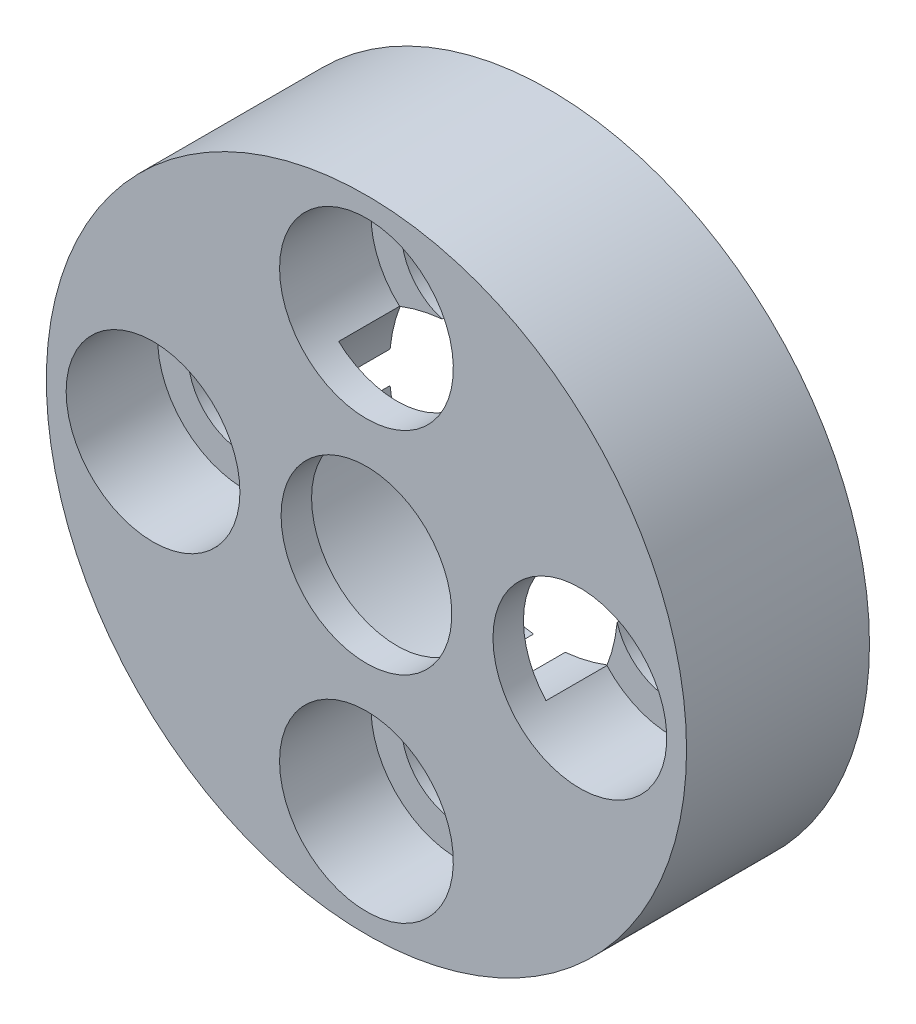
ISO-10303-21;
HEADER;
FILE_DESCRIPTION(('STEP AP214'),'2;1');
FILE_NAME('part.step','',(''),(''),'','','');
FILE_SCHEMA(('AUTOMOTIVE_DESIGN { 1 0 10303 214 1 1 1 1 }'));
ENDSEC;
DATA;
#1=APPLICATION_CONTEXT('core data for automotive mechanical design processes');
#2=APPLICATION_PROTOCOL_DEFINITION('international standard','automotive_design',2000,#1);
#3=PRODUCT_CONTEXT('',#1,'mechanical');
#4=PRODUCT('Part','Part','',(#3));
#5=PRODUCT_RELATED_PRODUCT_CATEGORY('part','',(#4));
#6=PRODUCT_DEFINITION_FORMATION('','',#4);
#7=PRODUCT_DEFINITION_CONTEXT('part definition',#1,'design');
#8=PRODUCT_DEFINITION('design','',#6,#7);
#9=PRODUCT_DEFINITION_SHAPE('','',#8);
#10=(LENGTH_UNIT() NAMED_UNIT(*) SI_UNIT(.MILLI.,.METRE.));
#11=(NAMED_UNIT(*) PLANE_ANGLE_UNIT() SI_UNIT($,.RADIAN.));
#12=(NAMED_UNIT(*) SI_UNIT($,.STERADIAN.) SOLID_ANGLE_UNIT());
#13=UNCERTAINTY_MEASURE_WITH_UNIT(LENGTH_MEASURE(1.E-05),#10,'distance_accuracy_value','');
#14=(GEOMETRIC_REPRESENTATION_CONTEXT(3) GLOBAL_UNCERTAINTY_ASSIGNED_CONTEXT((#13)) GLOBAL_UNIT_ASSIGNED_CONTEXT((#10,
#11,#12)) REPRESENTATION_CONTEXT('',''));
#15=CARTESIAN_POINT('',(0.,0.,0.));
#16=DIRECTION('',(0.,0.,1.));
#17=DIRECTION('',(1.,0.,0.));
#18=AXIS2_PLACEMENT_3D('',#15,#16,#17);
#19=CARTESIAN_POINT('',(0.,0.,6.));
#20=DIRECTION('',(0.,0.,1.));
#21=DIRECTION('',(1.,0.,0.));
#22=AXIS2_PLACEMENT_3D('',#19,#20,#21);
#23=PLANE('',#22);
#24=CARTESIAN_POINT('',(0.,-7.,6.));
#25=DIRECTION('',(0.,0.,-1.));
#26=DIRECTION('',(-1.,0.,0.));
#27=AXIS2_PLACEMENT_3D('',#24,#25,#26);
#28=CIRCLE('',#27,2.85);
#29=CARTESIAN_POINT('',(-2.85,-7.,6.));
#30=VERTEX_POINT('',#29);
#31=EDGE_CURVE('E174',#30,#30,#28,.T.);
#32=ORIENTED_EDGE('',*,*,#31,.T.);
#33=EDGE_LOOP('',(#32));
#34=FACE_BOUND('',#33,.T.);
#35=CARTESIAN_POINT('',(0.,7.,6.));
#36=DIRECTION('',(0.,0.,-1.));
#37=DIRECTION('',(-1.,0.,0.));
#38=AXIS2_PLACEMENT_3D('',#35,#36,#37);
#39=CIRCLE('',#38,2.85);
#40=CARTESIAN_POINT('',(-2.85,7.,6.));
#41=VERTEX_POINT('',#40);
#42=EDGE_CURVE('E284',#41,#41,#39,.T.);
#43=ORIENTED_EDGE('',*,*,#42,.T.);
#44=EDGE_LOOP('',(#43));
#45=FACE_BOUND('',#44,.T.);
#46=CARTESIAN_POINT('',(0.,0.,6.));
#47=DIRECTION('',(0.,0.,-1.));
#48=DIRECTION('',(-1.,0.,0.));
#49=AXIS2_PLACEMENT_3D('',#46,#47,#48);
#50=CIRCLE('',#49,2.8);
#51=CARTESIAN_POINT('',(-2.8,0.,6.));
#52=VERTEX_POINT('',#51);
#53=EDGE_CURVE('E207',#52,#52,#50,.T.);
#54=ORIENTED_EDGE('',*,*,#53,.T.);
#55=EDGE_LOOP('',(#54));
#56=FACE_BOUND('',#55,.T.);
#57=CARTESIAN_POINT('',(0.,0.,6.));
#58=DIRECTION('',(0.,0.,1.));
#59=DIRECTION('',(1.,0.,0.));
#60=AXIS2_PLACEMENT_3D('',#57,#58,#59);
#61=CIRCLE('',#60,10.5);
#62=CARTESIAN_POINT('',(10.5,0.,6.));
#63=VERTEX_POINT('',#62);
#64=EDGE_CURVE('E248',#63,#63,#61,.T.);
#65=ORIENTED_EDGE('',*,*,#64,.T.);
#66=EDGE_LOOP('',(#65));
#67=FACE_BOUND('',#66,.T.);
#68=CARTESIAN_POINT('',(7.,0.,6.));
#69=DIRECTION('',(0.,0.,-1.));
#70=DIRECTION('',(-1.,0.,0.));
#71=AXIS2_PLACEMENT_3D('',#68,#69,#70);
#72=CIRCLE('',#71,2.85);
#73=CARTESIAN_POINT('',(4.15,0.,6.));
#74=VERTEX_POINT('',#73);
#75=EDGE_CURVE('E335',#74,#74,#72,.T.);
#76=ORIENTED_EDGE('',*,*,#75,.T.);
#77=EDGE_LOOP('',(#76));
#78=FACE_BOUND('',#77,.T.);
#79=CARTESIAN_POINT('',(-7.,0.,6.));
#80=DIRECTION('',(0.,0.,-1.));
#81=DIRECTION('',(-1.,0.,0.));
#82=AXIS2_PLACEMENT_3D('',#79,#80,#81);
#83=CIRCLE('',#82,2.85);
#84=CARTESIAN_POINT('',(-9.85,0.,6.));
#85=VERTEX_POINT('',#84);
#86=EDGE_CURVE('E485',#85,#85,#83,.T.);
#87=ORIENTED_EDGE('',*,*,#86,.T.);
#88=EDGE_LOOP('',(#87));
#89=FACE_BOUND('',#88,.T.);
#90=ADVANCED_FACE('F41',(#34,#45,#56,#67,#78,#89),#23,.T.);
#91=CARTESIAN_POINT('',(7.,0.,6.));
#92=DIRECTION('',(0.,0.,-1.));
#93=DIRECTION('',(-1.,0.,0.));
#94=AXIS2_PLACEMENT_3D('',#91,#92,#93);
#95=CYLINDRICAL_SURFACE('',#94,1.85);
#96=DIRECTION('',(0.,0.,-1.));
#97=VECTOR('',#96,1.);
#98=CARTESIAN_POINT('',(5.22428571428572,-0.518978588681864,2.5));
#99=LINE('',#98,#97);
#100=CARTESIAN_POINT('',(5.22428571428572,-0.518978588681864,3.));
#101=VERTEX_POINT('',#100);
#102=CARTESIAN_POINT('',(5.22428571428572,-0.518978588681863,0.));
#103=VERTEX_POINT('',#102);
#104=EDGE_CURVE('E230',#101,#103,#99,.T.);
#105=ORIENTED_EDGE('',*,*,#104,.F.);
#106=CARTESIAN_POINT('',(7.,0.,3.));
#107=DIRECTION('',(0.,0.,1.));
#108=DIRECTION('',(1.,0.,0.));
#109=AXIS2_PLACEMENT_3D('',#106,#107,#108);
#110=CIRCLE('',#109,1.85);
#111=CARTESIAN_POINT('',(5.22428571428572,0.518978588681865,3.));
#112=VERTEX_POINT('',#111);
#113=EDGE_CURVE('E317',#101,#112,#110,.T.);
#114=ORIENTED_EDGE('',*,*,#113,.T.);
#115=DIRECTION('',(0.,0.,-1.));
#116=VECTOR('',#115,1.);
#117=CARTESIAN_POINT('',(5.22428571428572,0.518978588681865,2.5));
#118=LINE('',#117,#116);
#119=CARTESIAN_POINT('',(5.22428571428572,0.518978588681865,0.));
#120=VERTEX_POINT('',#119);
#121=EDGE_CURVE('E232',#120,#112,#118,.F.);
#122=ORIENTED_EDGE('',*,*,#121,.F.);
#123=CARTESIAN_POINT('',(7.,0.,0.));
#124=DIRECTION('',(0.,0.,1.));
#125=DIRECTION('',(1.,0.,0.));
#126=AXIS2_PLACEMENT_3D('',#123,#124,#125);
#127=CIRCLE('',#126,1.85);
#128=EDGE_CURVE('E244',#103,#120,#127,.T.);
#129=ORIENTED_EDGE('',*,*,#128,.F.);
#130=EDGE_LOOP('',(#105,#114,#122,#129));
#131=FACE_BOUND('',#130,.T.);
#132=ADVANCED_FACE('F316',(#131),#95,.F.);
#133=CARTESIAN_POINT('',(0.,-7.,6.));
#134=DIRECTION('',(0.,0.,-1.));
#135=DIRECTION('',(-1.,0.,0.));
#136=AXIS2_PLACEMENT_3D('',#133,#134,#135);
#137=CYLINDRICAL_SURFACE('',#136,1.85);
#138=DIRECTION('',(0.,0.,-1.));
#139=VECTOR('',#138,1.);
#140=CARTESIAN_POINT('',(-0.518978588681849,-5.22428571428571,2.5));
#141=LINE('',#140,#139);
#142=CARTESIAN_POINT('',(-0.518978588681849,-5.22428571428571,3.));
#143=VERTEX_POINT('',#142);
#144=CARTESIAN_POINT('',(-0.518978588681849,-5.22428571428571,0.));
#145=VERTEX_POINT('',#144);
#146=EDGE_CURVE('E227',#143,#145,#141,.T.);
#147=ORIENTED_EDGE('',*,*,#146,.F.);
#148=CARTESIAN_POINT('',(0.,-7.,3.));
#149=DIRECTION('',(0.,0.,1.));
#150=DIRECTION('',(1.,0.,0.));
#151=AXIS2_PLACEMENT_3D('',#148,#149,#150);
#152=CIRCLE('',#151,1.85);
#153=CARTESIAN_POINT('',(0.518978588681852,-5.22428571428572,3.));
#154=VERTEX_POINT('',#153);
#155=EDGE_CURVE('E181',#143,#154,#152,.T.);
#156=ORIENTED_EDGE('',*,*,#155,.T.);
#157=DIRECTION('',(0.,0.,-1.));
#158=VECTOR('',#157,1.);
#159=CARTESIAN_POINT('',(0.518978588681851,-5.22428571428571,2.5));
#160=LINE('',#159,#158);
#161=CARTESIAN_POINT('',(0.518978588681852,-5.22428571428571,0.));
#162=VERTEX_POINT('',#161);
#163=EDGE_CURVE('E180',#162,#154,#160,.F.);
#164=ORIENTED_EDGE('',*,*,#163,.F.);
#165=CARTESIAN_POINT('',(0.,-7.,0.));
#166=DIRECTION('',(0.,0.,1.));
#167=DIRECTION('',(1.,0.,0.));
#168=AXIS2_PLACEMENT_3D('',#165,#166,#167);
#169=CIRCLE('',#168,1.85);
#170=EDGE_CURVE('E241',#145,#162,#169,.T.);
#171=ORIENTED_EDGE('',*,*,#170,.F.);
#172=EDGE_LOOP('',(#147,#156,#164,#171));
#173=FACE_BOUND('',#172,.T.);
#174=ADVANCED_FACE('F319',(#173),#137,.F.);
#175=CARTESIAN_POINT('',(0.,7.,6.));
#176=DIRECTION('',(0.,0.,-1.));
#177=DIRECTION('',(-1.,0.,0.));
#178=AXIS2_PLACEMENT_3D('',#175,#176,#177);
#179=CYLINDRICAL_SURFACE('',#178,1.85);
#180=DIRECTION('',(0.,0.,-1.));
#181=VECTOR('',#180,1.);
#182=CARTESIAN_POINT('',(0.518978588681851,5.22428571428571,2.5));
#183=LINE('',#182,#181);
#184=CARTESIAN_POINT('',(0.518978588681851,5.22428571428571,3.));
#185=VERTEX_POINT('',#184);
#186=CARTESIAN_POINT('',(0.518978588681851,5.22428571428571,0.));
#187=VERTEX_POINT('',#186);
#188=EDGE_CURVE('E221',#185,#187,#183,.T.);
#189=ORIENTED_EDGE('',*,*,#188,.F.);
#190=CARTESIAN_POINT('',(0.,7.,3.));
#191=DIRECTION('',(0.,0.,1.));
#192=DIRECTION('',(1.,0.,0.));
#193=AXIS2_PLACEMENT_3D('',#190,#191,#192);
#194=CIRCLE('',#193,1.85);
#195=CARTESIAN_POINT('',(-0.518978588681849,5.22428571428571,3.));
#196=VERTEX_POINT('',#195);
#197=EDGE_CURVE('E274',#185,#196,#194,.T.);
#198=ORIENTED_EDGE('',*,*,#197,.T.);
#199=DIRECTION('',(0.,0.,-1.));
#200=VECTOR('',#199,1.);
#201=CARTESIAN_POINT('',(-0.518978588681849,5.22428571428571,2.5));
#202=LINE('',#201,#200);
#203=CARTESIAN_POINT('',(-0.518978588681849,5.22428571428571,0.));
#204=VERTEX_POINT('',#203);
#205=EDGE_CURVE('E223',#204,#196,#202,.F.);
#206=ORIENTED_EDGE('',*,*,#205,.F.);
#207=CARTESIAN_POINT('',(0.,7.,0.));
#208=DIRECTION('',(0.,0.,1.));
#209=DIRECTION('',(1.,0.,0.));
#210=AXIS2_PLACEMENT_3D('',#207,#208,#209);
#211=CIRCLE('',#210,1.85);
#212=EDGE_CURVE('E238',#187,#204,#211,.T.);
#213=ORIENTED_EDGE('',*,*,#212,.F.);
#214=EDGE_LOOP('',(#189,#198,#206,#213));
#215=FACE_BOUND('',#214,.T.);
#216=ADVANCED_FACE('F282',(#215),#179,.F.);
#217=CARTESIAN_POINT('',(-7.,0.,6.));
#218=DIRECTION('',(0.,0.,-1.));
#219=DIRECTION('',(-1.,0.,0.));
#220=AXIS2_PLACEMENT_3D('',#217,#218,#219);
#221=CYLINDRICAL_SURFACE('',#220,1.85);
#222=DIRECTION('',(0.,0.,-1.));
#223=VECTOR('',#222,1.);
#224=CARTESIAN_POINT('',(-5.22428571428571,0.518978588681842,2.5));
#225=LINE('',#224,#223);
#226=CARTESIAN_POINT('',(-5.22428571428571,0.518978588681842,3.));
#227=VERTEX_POINT('',#226);
#228=CARTESIAN_POINT('',(-5.22428571428571,0.518978588681842,0.));
#229=VERTEX_POINT('',#228);
#230=EDGE_CURVE('E251',#227,#229,#225,.T.);
#231=ORIENTED_EDGE('',*,*,#230,.F.);
#232=CARTESIAN_POINT('',(-7.,0.,3.));
#233=DIRECTION('',(0.,0.,1.));
#234=DIRECTION('',(1.,0.,0.));
#235=AXIS2_PLACEMENT_3D('',#232,#233,#234);
#236=CIRCLE('',#235,1.85);
#237=CARTESIAN_POINT('',(-5.22428571428571,-0.518978588681842,3.));
#238=VERTEX_POINT('',#237);
#239=EDGE_CURVE('E166',#227,#238,#236,.T.);
#240=ORIENTED_EDGE('',*,*,#239,.T.);
#241=DIRECTION('',(0.,0.,-1.));
#242=VECTOR('',#241,1.);
#243=CARTESIAN_POINT('',(-5.22428571428571,-0.518978588681841,2.5));
#244=LINE('',#243,#242);
#245=CARTESIAN_POINT('',(-5.22428571428571,-0.518978588681841,0.));
#246=VERTEX_POINT('',#245);
#247=EDGE_CURVE('E255',#246,#238,#244,.F.);
#248=ORIENTED_EDGE('',*,*,#247,.F.);
#249=CARTESIAN_POINT('',(-7.,0.,0.));
#250=DIRECTION('',(0.,0.,1.));
#251=DIRECTION('',(1.,0.,0.));
#252=AXIS2_PLACEMENT_3D('',#249,#250,#251);
#253=CIRCLE('',#252,1.85);
#254=EDGE_CURVE('E235',#229,#246,#253,.T.);
#255=ORIENTED_EDGE('',*,*,#254,.F.);
#256=EDGE_LOOP('',(#231,#240,#248,#255));
#257=FACE_BOUND('',#256,.T.);
#258=ADVANCED_FACE('F298',(#257),#221,.F.);
#259=CARTESIAN_POINT('',(0.,0.,20.8492424049175));
#260=DIRECTION('',(0.,0.,-1.));
#261=DIRECTION('',(-1.,0.,0.));
#262=AXIS2_PLACEMENT_3D('',#259,#260,#261);
#263=CYLINDRICAL_SURFACE('',#262,5.25);
#264=DIRECTION('',(0.,0.,1.));
#265=VECTOR('',#264,1.);
#266=CARTESIAN_POINT('',(4.88857142857143,1.91425426413398,4.5));
#267=LINE('',#266,#265);
#268=CARTESIAN_POINT('',(4.88857142857143,1.91425426413398,5.));
#269=VERTEX_POINT('',#268);
#270=CARTESIAN_POINT('',(4.88857142857143,1.91425426413398,3.));
#271=VERTEX_POINT('',#270);
#272=EDGE_CURVE('E200',#269,#271,#267,.F.);
#273=ORIENTED_EDGE('',*,*,#272,.F.);
#274=CARTESIAN_POINT('',(0.,0.,5.));
#275=DIRECTION('',(0.,0.,1.));
#276=DIRECTION('',(1.,0.,0.));
#277=AXIS2_PLACEMENT_3D('',#274,#275,#276);
#278=CIRCLE('',#277,5.25);
#279=CARTESIAN_POINT('',(1.91425426413397,4.88857142857143,5.));
#280=VERTEX_POINT('',#279);
#281=EDGE_CURVE('E215',#280,#269,#278,.F.);
#282=ORIENTED_EDGE('',*,*,#281,.F.);
#283=DIRECTION('',(0.,0.,1.));
#284=VECTOR('',#283,1.);
#285=CARTESIAN_POINT('',(1.91425426413398,4.88857142857143,4.5));
#286=LINE('',#285,#284);
#287=CARTESIAN_POINT('',(1.91425426413398,4.88857142857143,3.));
#288=VERTEX_POINT('',#287);
#289=EDGE_CURVE('E56',#288,#280,#286,.T.);
#290=ORIENTED_EDGE('',*,*,#289,.F.);
#291=CARTESIAN_POINT('',(0.,0.,3.));
#292=DIRECTION('',(0.,0.,1.));
#293=DIRECTION('',(1.,0.,0.));
#294=AXIS2_PLACEMENT_3D('',#291,#292,#293);
#295=CIRCLE('',#294,5.25);
#296=EDGE_CURVE('E202',#185,#288,#295,.F.);
#297=ORIENTED_EDGE('',*,*,#296,.F.);
#298=ORIENTED_EDGE('',*,*,#188,.T.);
#299=CARTESIAN_POINT('',(0.,0.,0.));
#300=DIRECTION('',(0.,0.,-1.));
#301=DIRECTION('',(-1.,0.,0.));
#302=AXIS2_PLACEMENT_3D('',#299,#300,#301);
#303=CIRCLE('',#302,5.25);
#304=EDGE_CURVE('E216',#187,#120,#303,.T.);
#305=ORIENTED_EDGE('',*,*,#304,.T.);
#306=ORIENTED_EDGE('',*,*,#121,.T.);
#307=CARTESIAN_POINT('',(0.,0.,3.));
#308=DIRECTION('',(0.,0.,1.));
#309=DIRECTION('',(1.,0.,0.));
#310=AXIS2_PLACEMENT_3D('',#307,#308,#309);
#311=CIRCLE('',#310,5.25);
#312=EDGE_CURVE('E204',#271,#112,#311,.F.);
#313=ORIENTED_EDGE('',*,*,#312,.F.);
#314=EDGE_LOOP('',(#273,#282,#290,#297,#298,#305,#306,#313));
#315=FACE_BOUND('',#314,.T.);
#316=ADVANCED_FACE('F310',(#315),#263,.F.);
#317=DIRECTION('',(0.,0.,1.));
#318=VECTOR('',#317,1.);
#319=CARTESIAN_POINT('',(1.91425426413397,-4.88857142857143,4.5));
#320=LINE('',#319,#318);
#321=CARTESIAN_POINT('',(1.91425426413397,-4.88857142857143,5.));
#322=VERTEX_POINT('',#321);
#323=CARTESIAN_POINT('',(1.91425426413397,-4.88857142857143,3.));
#324=VERTEX_POINT('',#323);
#325=EDGE_CURVE('E155',#322,#324,#320,.F.);
#326=ORIENTED_EDGE('',*,*,#325,.F.);
#327=CARTESIAN_POINT('',(4.88857142857143,-1.91425426413398,5.));
#328=VERTEX_POINT('',#327);
#329=EDGE_CURVE('E224',#328,#322,#278,.F.);
#330=ORIENTED_EDGE('',*,*,#329,.F.);
#331=DIRECTION('',(0.,0.,1.));
#332=VECTOR('',#331,1.);
#333=CARTESIAN_POINT('',(4.88857142857143,-1.91425426413398,4.5));
#334=LINE('',#333,#332);
#335=CARTESIAN_POINT('',(4.88857142857143,-1.91425426413398,3.));
#336=VERTEX_POINT('',#335);
#337=EDGE_CURVE('E64',#336,#328,#334,.T.);
#338=ORIENTED_EDGE('',*,*,#337,.F.);
#339=CARTESIAN_POINT('',(0.,0.,3.));
#340=DIRECTION('',(0.,0.,1.));
#341=DIRECTION('',(1.,0.,0.));
#342=AXIS2_PLACEMENT_3D('',#339,#340,#341);
#343=CIRCLE('',#342,5.25);
#344=EDGE_CURVE('E12',#101,#336,#343,.F.);
#345=ORIENTED_EDGE('',*,*,#344,.F.);
#346=ORIENTED_EDGE('',*,*,#104,.T.);
#347=EDGE_CURVE('E305',#103,#162,#303,.T.);
#348=ORIENTED_EDGE('',*,*,#347,.T.);
#349=ORIENTED_EDGE('',*,*,#163,.T.);
#350=CARTESIAN_POINT('',(0.,0.,3.));
#351=DIRECTION('',(0.,0.,1.));
#352=DIRECTION('',(1.,0.,0.));
#353=AXIS2_PLACEMENT_3D('',#350,#351,#352);
#354=CIRCLE('',#353,5.25);
#355=EDGE_CURVE('E170',#324,#154,#354,.F.);
#356=ORIENTED_EDGE('',*,*,#355,.F.);
#357=EDGE_LOOP('',(#326,#330,#338,#345,#346,#348,#349,#356));
#358=FACE_BOUND('',#357,.T.);
#359=ADVANCED_FACE('F178',(#358),#263,.F.);
#360=DIRECTION('',(0.,0.,1.));
#361=VECTOR('',#360,1.);
#362=CARTESIAN_POINT('',(-4.88857142857143,1.91425426413397,4.5));
#363=LINE('',#362,#361);
#364=CARTESIAN_POINT('',(-4.88857142857143,1.91425426413397,3.));
#365=VERTEX_POINT('',#364);
#366=CARTESIAN_POINT('',(-4.88857142857143,1.91425426413397,5.));
#367=VERTEX_POINT('',#366);
#368=EDGE_CURVE('E194',#365,#367,#363,.T.);
#369=ORIENTED_EDGE('',*,*,#368,.F.);
#370=CARTESIAN_POINT('',(0.,0.,3.));
#371=DIRECTION('',(0.,0.,1.));
#372=DIRECTION('',(1.,0.,0.));
#373=AXIS2_PLACEMENT_3D('',#370,#371,#372);
#374=CIRCLE('',#373,5.25);
#375=EDGE_CURVE('E190',#227,#365,#374,.F.);
#376=ORIENTED_EDGE('',*,*,#375,.F.);
#377=ORIENTED_EDGE('',*,*,#230,.T.);
#378=EDGE_CURVE('E213',#229,#204,#303,.T.);
#379=ORIENTED_EDGE('',*,*,#378,.T.);
#380=ORIENTED_EDGE('',*,*,#205,.T.);
#381=CARTESIAN_POINT('',(0.,0.,3.));
#382=DIRECTION('',(0.,0.,1.));
#383=DIRECTION('',(1.,0.,0.));
#384=AXIS2_PLACEMENT_3D('',#381,#382,#383);
#385=CIRCLE('',#384,5.25);
#386=CARTESIAN_POINT('',(-1.91425426413397,4.88857142857143,3.));
#387=VERTEX_POINT('',#386);
#388=EDGE_CURVE('E49',#387,#196,#385,.F.);
#389=ORIENTED_EDGE('',*,*,#388,.F.);
#390=DIRECTION('',(0.,0.,1.));
#391=VECTOR('',#390,1.);
#392=CARTESIAN_POINT('',(-1.91425426413397,4.88857142857143,4.5));
#393=LINE('',#392,#391);
#394=CARTESIAN_POINT('',(-1.91425426413397,4.88857142857143,5.));
#395=VERTEX_POINT('',#394);
#396=EDGE_CURVE('E196',#395,#387,#393,.F.);
#397=ORIENTED_EDGE('',*,*,#396,.F.);
#398=EDGE_CURVE('E219',#367,#395,#278,.F.);
#399=ORIENTED_EDGE('',*,*,#398,.F.);
#400=EDGE_LOOP('',(#369,#376,#377,#379,#380,#389,#397,#399));
#401=FACE_BOUND('',#400,.T.);
#402=ADVANCED_FACE('F287',(#401),#263,.F.);
#403=CARTESIAN_POINT('',(0.,0.,5.));
#404=DIRECTION('',(0.,0.,1.));
#405=DIRECTION('',(1.,0.,0.));
#406=AXIS2_PLACEMENT_3D('',#403,#404,#405);
#407=PLANE('',#406);
#408=CARTESIAN_POINT('',(0.,0.,5.));
#409=DIRECTION('',(0.,0.,-1.));
#410=DIRECTION('',(-1.,0.,0.));
#411=AXIS2_PLACEMENT_3D('',#408,#409,#410);
#412=CIRCLE('',#411,2.8);
#413=CARTESIAN_POINT('',(-2.8,0.,5.));
#414=VERTEX_POINT('',#413);
#415=EDGE_CURVE('E206',#414,#414,#412,.T.);
#416=ORIENTED_EDGE('',*,*,#415,.F.);
#417=EDGE_LOOP('',(#416));
#418=FACE_BOUND('',#417,.T.);
#419=CARTESIAN_POINT('',(-7.,0.,5.));
#420=DIRECTION('',(0.,0.,1.));
#421=DIRECTION('',(1.,0.,0.));
#422=AXIS2_PLACEMENT_3D('',#419,#420,#421);
#423=CIRCLE('',#422,2.85);
#424=CARTESIAN_POINT('',(-4.88857142857143,-1.91425426413397,5.));
#425=VERTEX_POINT('',#424);
#426=EDGE_CURVE('E192',#367,#425,#423,.F.);
#427=ORIENTED_EDGE('',*,*,#426,.F.);
#428=ORIENTED_EDGE('',*,*,#398,.T.);
#429=CARTESIAN_POINT('',(0.,7.,5.));
#430=DIRECTION('',(0.,0.,1.));
#431=DIRECTION('',(1.,0.,0.));
#432=AXIS2_PLACEMENT_3D('',#429,#430,#431);
#433=CIRCLE('',#432,2.85);
#434=EDGE_CURVE('E266',#280,#395,#433,.F.);
#435=ORIENTED_EDGE('',*,*,#434,.F.);
#436=ORIENTED_EDGE('',*,*,#281,.T.);
#437=CARTESIAN_POINT('',(7.,0.,5.));
#438=DIRECTION('',(0.,0.,1.));
#439=DIRECTION('',(1.,0.,0.));
#440=AXIS2_PLACEMENT_3D('',#437,#438,#439);
#441=CIRCLE('',#440,2.85);
#442=EDGE_CURVE('E268',#328,#269,#441,.F.);
#443=ORIENTED_EDGE('',*,*,#442,.F.);
#444=ORIENTED_EDGE('',*,*,#329,.T.);
#445=CARTESIAN_POINT('',(0.,-7.,5.));
#446=DIRECTION('',(0.,0.,1.));
#447=DIRECTION('',(1.,0.,0.));
#448=AXIS2_PLACEMENT_3D('',#445,#446,#447);
#449=CIRCLE('',#448,2.85);
#450=CARTESIAN_POINT('',(-1.91425426413397,-4.88857142857143,5.));
#451=VERTEX_POINT('',#450);
#452=EDGE_CURVE('E161',#451,#322,#449,.F.);
#453=ORIENTED_EDGE('',*,*,#452,.F.);
#454=EDGE_CURVE('E220',#451,#425,#278,.F.);
#455=ORIENTED_EDGE('',*,*,#454,.T.);
#456=EDGE_LOOP('',(#427,#428,#435,#436,#443,#444,#453,#455));
#457=FACE_BOUND('',#456,.T.);
#458=ADVANCED_FACE('F324',(#418,#457),#407,.F.);
#459=DIRECTION('',(0.,0.,1.));
#460=VECTOR('',#459,1.);
#461=CARTESIAN_POINT('',(-4.88857142857143,-1.91425426413397,4.5));
#462=LINE('',#461,#460);
#463=CARTESIAN_POINT('',(-4.88857142857143,-1.91425426413397,3.));
#464=VERTEX_POINT('',#463);
#465=EDGE_CURVE('E263',#425,#464,#462,.F.);
#466=ORIENTED_EDGE('',*,*,#465,.F.);
#467=ORIENTED_EDGE('',*,*,#454,.F.);
#468=DIRECTION('',(0.,0.,1.));
#469=VECTOR('',#468,1.);
#470=CARTESIAN_POINT('',(-1.91425426413397,-4.88857142857143,4.5));
#471=LINE('',#470,#469);
#472=CARTESIAN_POINT('',(-1.91425426413397,-4.88857142857143,3.));
#473=VERTEX_POINT('',#472);
#474=EDGE_CURVE('E259',#473,#451,#471,.T.);
#475=ORIENTED_EDGE('',*,*,#474,.F.);
#476=CARTESIAN_POINT('',(0.,0.,3.));
#477=DIRECTION('',(0.,0.,1.));
#478=DIRECTION('',(1.,0.,0.));
#479=AXIS2_PLACEMENT_3D('',#476,#477,#478);
#480=CIRCLE('',#479,5.25);
#481=EDGE_CURVE('E173',#143,#473,#480,.F.);
#482=ORIENTED_EDGE('',*,*,#481,.F.);
#483=ORIENTED_EDGE('',*,*,#146,.T.);
#484=EDGE_CURVE('E210',#145,#246,#303,.T.);
#485=ORIENTED_EDGE('',*,*,#484,.T.);
#486=ORIENTED_EDGE('',*,*,#247,.T.);
#487=CARTESIAN_POINT('',(0.,0.,3.));
#488=DIRECTION('',(0.,0.,1.));
#489=DIRECTION('',(1.,0.,0.));
#490=AXIS2_PLACEMENT_3D('',#487,#488,#489);
#491=CIRCLE('',#490,5.25);
#492=EDGE_CURVE('E261',#464,#238,#491,.F.);
#493=ORIENTED_EDGE('',*,*,#492,.F.);
#494=EDGE_LOOP('',(#466,#467,#475,#482,#483,#485,#486,#493));
#495=FACE_BOUND('',#494,.T.);
#496=ADVANCED_FACE('F302',(#495),#263,.F.);
#497=CARTESIAN_POINT('',(0.,0.,0.));
#498=DIRECTION('',(0.,0.,1.));
#499=DIRECTION('',(1.,0.,0.));
#500=AXIS2_PLACEMENT_3D('',#497,#498,#499);
#501=PLANE('',#500);
#502=CARTESIAN_POINT('',(0.,0.,0.));
#503=DIRECTION('',(0.,0.,1.));
#504=DIRECTION('',(1.,0.,0.));
#505=AXIS2_PLACEMENT_3D('',#502,#503,#504);
#506=CIRCLE('',#505,10.5);
#507=CARTESIAN_POINT('',(10.5,0.,0.));
#508=VERTEX_POINT('',#507);
#509=EDGE_CURVE('E247',#508,#508,#506,.T.);
#510=ORIENTED_EDGE('',*,*,#509,.F.);
#511=EDGE_LOOP('',(#510));
#512=FACE_BOUND('',#511,.T.);
#513=ORIENTED_EDGE('',*,*,#128,.T.);
#514=ORIENTED_EDGE('',*,*,#304,.F.);
#515=ORIENTED_EDGE('',*,*,#212,.T.);
#516=ORIENTED_EDGE('',*,*,#378,.F.);
#517=ORIENTED_EDGE('',*,*,#254,.T.);
#518=ORIENTED_EDGE('',*,*,#484,.F.);
#519=ORIENTED_EDGE('',*,*,#170,.T.);
#520=ORIENTED_EDGE('',*,*,#347,.F.);
#521=EDGE_LOOP('',(#513,#514,#515,#516,#517,#518,#519,#520));
#522=FACE_BOUND('',#521,.T.);
#523=ADVANCED_FACE('F293',(#512,#522),#501,.F.);
#524=CARTESIAN_POINT('',(0.,0.,6.));
#525=DIRECTION('',(0.,0.,-1.));
#526=DIRECTION('',(-1.,0.,0.));
#527=AXIS2_PLACEMENT_3D('',#524,#525,#526);
#528=CYLINDRICAL_SURFACE('',#527,10.5);
#529=ORIENTED_EDGE('',*,*,#64,.F.);
#530=EDGE_LOOP('',(#529));
#531=FACE_BOUND('',#530,.T.);
#532=ORIENTED_EDGE('',*,*,#509,.T.);
#533=EDGE_LOOP('',(#532));
#534=FACE_BOUND('',#533,.T.);
#535=ADVANCED_FACE('F43',(#531,#534),#528,.T.);
#536=CARTESIAN_POINT('',(0.,0.,6.));
#537=DIRECTION('',(0.,0.,-1.));
#538=DIRECTION('',(-1.,0.,0.));
#539=AXIS2_PLACEMENT_3D('',#536,#537,#538);
#540=CYLINDRICAL_SURFACE('',#539,2.8);
#541=ORIENTED_EDGE('',*,*,#53,.F.);
#542=EDGE_LOOP('',(#541));
#543=FACE_BOUND('',#542,.T.);
#544=ORIENTED_EDGE('',*,*,#415,.T.);
#545=EDGE_LOOP('',(#544));
#546=FACE_BOUND('',#545,.T.);
#547=ADVANCED_FACE('F371',(#543,#546),#540,.F.);
#548=CARTESIAN_POINT('',(0.,-7.,-8.06101730552664));
#549=DIRECTION('',(0.,0.,1.));
#550=DIRECTION('',(1.,0.,0.));
#551=AXIS2_PLACEMENT_3D('',#548,#549,#550);
#552=CYLINDRICAL_SURFACE('',#551,2.85);
#553=ORIENTED_EDGE('',*,*,#31,.F.);
#554=EDGE_LOOP('',(#553));
#555=FACE_BOUND('',#554,.T.);
#556=ORIENTED_EDGE('',*,*,#325,.T.);
#557=CARTESIAN_POINT('',(0.,-7.,3.));
#558=DIRECTION('',(0.,0.,1.));
#559=DIRECTION('',(1.,0.,0.));
#560=AXIS2_PLACEMENT_3D('',#557,#558,#559);
#561=CIRCLE('',#560,2.85);
#562=EDGE_CURVE('E158',#473,#324,#561,.T.);
#563=ORIENTED_EDGE('',*,*,#562,.F.);
#564=ORIENTED_EDGE('',*,*,#474,.T.);
#565=ORIENTED_EDGE('',*,*,#452,.T.);
#566=EDGE_LOOP('',(#556,#563,#564,#565));
#567=FACE_BOUND('',#566,.T.);
#568=ADVANCED_FACE('F157',(#555,#567),#552,.F.);
#569=CARTESIAN_POINT('',(0.,0.,3.));
#570=DIRECTION('',(0.,0.,1.));
#571=DIRECTION('',(1.,0.,0.));
#572=AXIS2_PLACEMENT_3D('',#569,#570,#571);
#573=PLANE('',#572);
#574=ORIENTED_EDGE('',*,*,#355,.T.);
#575=ORIENTED_EDGE('',*,*,#155,.F.);
#576=ORIENTED_EDGE('',*,*,#481,.T.);
#577=ORIENTED_EDGE('',*,*,#562,.T.);
#578=EDGE_LOOP('',(#574,#575,#576,#577));
#579=FACE_BOUND('',#578,.T.);
#580=ADVANCED_FACE('F169',(#579),#573,.T.);
#581=CARTESIAN_POINT('',(-7.,0.,-8.06101730552664));
#582=DIRECTION('',(0.,0.,1.));
#583=DIRECTION('',(1.,0.,0.));
#584=AXIS2_PLACEMENT_3D('',#581,#582,#583);
#585=CYLINDRICAL_SURFACE('',#584,2.85);
#586=ORIENTED_EDGE('',*,*,#86,.F.);
#587=EDGE_LOOP('',(#586));
#588=FACE_BOUND('',#587,.T.);
#589=ORIENTED_EDGE('',*,*,#368,.T.);
#590=ORIENTED_EDGE('',*,*,#426,.T.);
#591=ORIENTED_EDGE('',*,*,#465,.T.);
#592=CARTESIAN_POINT('',(-7.,0.,3.));
#593=DIRECTION('',(0.,0.,1.));
#594=DIRECTION('',(1.,0.,0.));
#595=AXIS2_PLACEMENT_3D('',#592,#593,#594);
#596=CIRCLE('',#595,2.85);
#597=EDGE_CURVE('E184',#365,#464,#596,.T.);
#598=ORIENTED_EDGE('',*,*,#597,.F.);
#599=EDGE_LOOP('',(#589,#590,#591,#598));
#600=FACE_BOUND('',#599,.T.);
#601=ADVANCED_FACE('F437',(#588,#600),#585,.F.);
#602=CARTESIAN_POINT('',(0.,0.,3.));
#603=DIRECTION('',(0.,0.,1.));
#604=DIRECTION('',(1.,0.,0.));
#605=AXIS2_PLACEMENT_3D('',#602,#603,#604);
#606=PLANE('',#605);
#607=ORIENTED_EDGE('',*,*,#375,.T.);
#608=ORIENTED_EDGE('',*,*,#597,.T.);
#609=ORIENTED_EDGE('',*,*,#492,.T.);
#610=ORIENTED_EDGE('',*,*,#239,.F.);
#611=EDGE_LOOP('',(#607,#608,#609,#610));
#612=FACE_BOUND('',#611,.T.);
#613=ADVANCED_FACE('F353',(#612),#606,.T.);
#614=CARTESIAN_POINT('',(0.,0.,3.));
#615=DIRECTION('',(0.,0.,1.));
#616=DIRECTION('',(1.,0.,0.));
#617=AXIS2_PLACEMENT_3D('',#614,#615,#616);
#618=PLANE('',#617);
#619=ORIENTED_EDGE('',*,*,#296,.T.);
#620=CARTESIAN_POINT('',(0.,7.,3.));
#621=DIRECTION('',(0.,0.,1.));
#622=DIRECTION('',(1.,0.,0.));
#623=AXIS2_PLACEMENT_3D('',#620,#621,#622);
#624=CIRCLE('',#623,2.85);
#625=EDGE_CURVE('E276',#288,#387,#624,.T.);
#626=ORIENTED_EDGE('',*,*,#625,.T.);
#627=ORIENTED_EDGE('',*,*,#388,.T.);
#628=ORIENTED_EDGE('',*,*,#197,.F.);
#629=EDGE_LOOP('',(#619,#626,#627,#628));
#630=FACE_BOUND('',#629,.T.);
#631=ADVANCED_FACE('F273',(#630),#618,.T.);
#632=CARTESIAN_POINT('',(0.,7.,-8.06101730552664));
#633=DIRECTION('',(0.,0.,1.));
#634=DIRECTION('',(1.,0.,0.));
#635=AXIS2_PLACEMENT_3D('',#632,#633,#634);
#636=CYLINDRICAL_SURFACE('',#635,2.85);
#637=ORIENTED_EDGE('',*,*,#42,.F.);
#638=EDGE_LOOP('',(#637));
#639=FACE_BOUND('',#638,.T.);
#640=ORIENTED_EDGE('',*,*,#289,.T.);
#641=ORIENTED_EDGE('',*,*,#434,.T.);
#642=ORIENTED_EDGE('',*,*,#396,.T.);
#643=ORIENTED_EDGE('',*,*,#625,.F.);
#644=EDGE_LOOP('',(#640,#641,#642,#643));
#645=FACE_BOUND('',#644,.T.);
#646=ADVANCED_FACE('F328',(#639,#645),#636,.F.);
#647=CARTESIAN_POINT('',(0.,0.,3.));
#648=DIRECTION('',(0.,0.,1.));
#649=DIRECTION('',(1.,0.,0.));
#650=AXIS2_PLACEMENT_3D('',#647,#648,#649);
#651=PLANE('',#650);
#652=ORIENTED_EDGE('',*,*,#312,.T.);
#653=ORIENTED_EDGE('',*,*,#113,.F.);
#654=ORIENTED_EDGE('',*,*,#344,.T.);
#655=CARTESIAN_POINT('',(7.,0.,3.));
#656=DIRECTION('',(0.,0.,1.));
#657=DIRECTION('',(1.,0.,0.));
#658=AXIS2_PLACEMENT_3D('',#655,#656,#657);
#659=CIRCLE('',#658,2.85);
#660=EDGE_CURVE('E175',#336,#271,#659,.T.);
#661=ORIENTED_EDGE('',*,*,#660,.T.);
#662=EDGE_LOOP('',(#652,#653,#654,#661));
#663=FACE_BOUND('',#662,.T.);
#664=ADVANCED_FACE('F333',(#663),#651,.T.);
#665=CARTESIAN_POINT('',(7.,0.,-8.06101730552664));
#666=DIRECTION('',(0.,0.,1.));
#667=DIRECTION('',(1.,0.,0.));
#668=AXIS2_PLACEMENT_3D('',#665,#666,#667);
#669=CYLINDRICAL_SURFACE('',#668,2.85);
#670=ORIENTED_EDGE('',*,*,#75,.F.);
#671=EDGE_LOOP('',(#670));
#672=FACE_BOUND('',#671,.T.);
#673=ORIENTED_EDGE('',*,*,#272,.T.);
#674=ORIENTED_EDGE('',*,*,#660,.F.);
#675=ORIENTED_EDGE('',*,*,#337,.T.);
#676=ORIENTED_EDGE('',*,*,#442,.T.);
#677=EDGE_LOOP('',(#673,#674,#675,#676));
#678=FACE_BOUND('',#677,.T.);
#679=ADVANCED_FACE('F331',(#672,#678),#669,.F.);
#680=CLOSED_SHELL('',(#90,#132,#174,#216,#258,#316,#359,#402,#458,#496,#523,#535,#547,#568,#580,
#601,#613,#631,#646,#664,#679));
#681=MANIFOLD_SOLID_BREP('B2',#680);
#682=ADVANCED_BREP_SHAPE_REPRESENTATION('',(#18,#681),#14);
#683=SHAPE_DEFINITION_REPRESENTATION(#9,#682);
ENDSEC;
END-ISO-10303-21;
